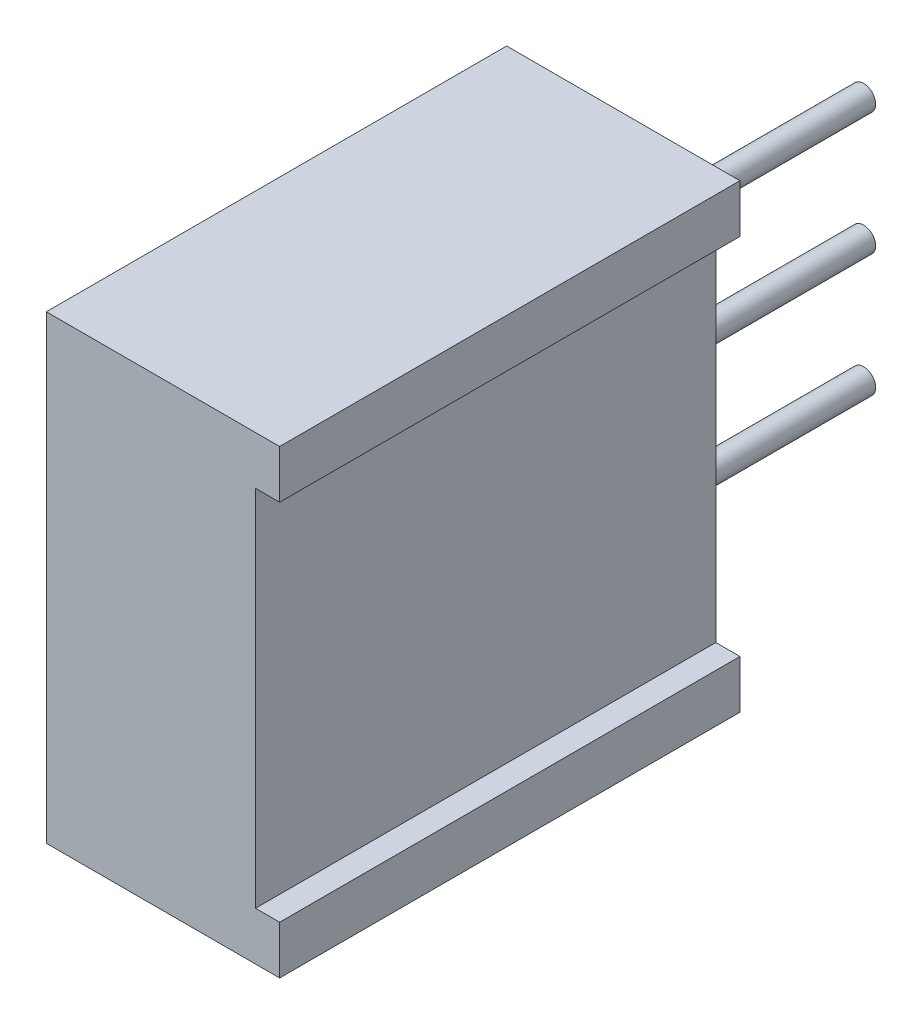
ISO-10303-21;
HEADER;
FILE_DESCRIPTION(('STEP AP214'),'2;1');
FILE_NAME('part.step','',(''),(''),'','','');
FILE_SCHEMA(('AUTOMOTIVE_DESIGN { 1 0 10303 214 1 1 1 1 }'));
ENDSEC;
DATA;
#1=APPLICATION_CONTEXT('core data for automotive mechanical design processes');
#2=APPLICATION_PROTOCOL_DEFINITION('international standard','automotive_design',2000,#1);
#3=PRODUCT_CONTEXT('',#1,'mechanical');
#4=PRODUCT('Part','Part','',(#3));
#5=PRODUCT_RELATED_PRODUCT_CATEGORY('part','',(#4));
#6=PRODUCT_DEFINITION_FORMATION('','',#4);
#7=PRODUCT_DEFINITION_CONTEXT('part definition',#1,'design');
#8=PRODUCT_DEFINITION('design','',#6,#7);
#9=PRODUCT_DEFINITION_SHAPE('','',#8);
#10=(LENGTH_UNIT() NAMED_UNIT(*) SI_UNIT(.MILLI.,.METRE.));
#11=(NAMED_UNIT(*) PLANE_ANGLE_UNIT() SI_UNIT($,.RADIAN.));
#12=(NAMED_UNIT(*) SI_UNIT($,.STERADIAN.) SOLID_ANGLE_UNIT());
#13=UNCERTAINTY_MEASURE_WITH_UNIT(LENGTH_MEASURE(1.E-05),#10,'distance_accuracy_value','');
#14=(GEOMETRIC_REPRESENTATION_CONTEXT(3) GLOBAL_UNCERTAINTY_ASSIGNED_CONTEXT((#13)) GLOBAL_UNIT_ASSIGNED_CONTEXT((#10,
#11,#12)) REPRESENTATION_CONTEXT('',''));
#15=CARTESIAN_POINT('',(0.,0.,0.));
#16=DIRECTION('',(0.,0.,1.));
#17=DIRECTION('',(1.,0.,0.));
#18=AXIS2_PLACEMENT_3D('',#15,#16,#17);
#19=CARTESIAN_POINT('',(4.83,0.,0.));
#20=DIRECTION('',(-1.,0.,0.));
#21=DIRECTION('',(0.,0.,1.));
#22=AXIS2_PLACEMENT_3D('',#19,#20,#21);
#23=PLANE('',#22);
#24=DIRECTION('',(0.,0.,1.));
#25=VECTOR('',#24,1.);
#26=CARTESIAN_POINT('',(4.83,-1.,0.));
#27=LINE('',#26,#25);
#28=CARTESIAN_POINT('',(4.83,-1.,0.));
#29=VERTEX_POINT('',#28);
#30=CARTESIAN_POINT('',(4.83,-1.,9.52999999999999));
#31=VERTEX_POINT('',#30);
#32=EDGE_CURVE('E42',#29,#31,#27,.T.);
#33=ORIENTED_EDGE('',*,*,#32,.F.);
#34=DIRECTION('',(0.,-1.,0.));
#35=VECTOR('',#34,1.);
#36=CARTESIAN_POINT('',(4.83,0.,0.));
#37=LINE('',#36,#35);
#38=CARTESIAN_POINT('',(4.83,0.,0.));
#39=VERTEX_POINT('',#38);
#40=EDGE_CURVE('E185',#39,#29,#37,.T.);
#41=ORIENTED_EDGE('',*,*,#40,.F.);
#42=DIRECTION('',(0.,0.,1.));
#43=VECTOR('',#42,1.);
#44=CARTESIAN_POINT('',(4.83,0.,0.));
#45=LINE('',#44,#43);
#46=CARTESIAN_POINT('',(4.83,0.,9.52999999999999));
#47=VERTEX_POINT('',#46);
#48=EDGE_CURVE('E146',#39,#47,#45,.T.);
#49=ORIENTED_EDGE('',*,*,#48,.T.);
#50=DIRECTION('',(0.,1.,0.));
#51=VECTOR('',#50,1.);
#52=CARTESIAN_POINT('',(4.83,-9.53,9.53));
#53=LINE('',#52,#51);
#54=EDGE_CURVE('E147',#31,#47,#53,.T.);
#55=ORIENTED_EDGE('',*,*,#54,.F.);
#56=EDGE_LOOP('',(#33,#41,#49,#55));
#57=FACE_BOUND('',#56,.T.);
#58=ADVANCED_FACE('F34',(#57),#23,.F.);
#59=CARTESIAN_POINT('',(4.83,0.,0.));
#60=DIRECTION('',(0.,0.,-1.));
#61=DIRECTION('',(-1.,0.,0.));
#62=AXIS2_PLACEMENT_3D('',#59,#60,#61);
#63=PLANE('',#62);
#64=DIRECTION('',(-1.,0.,0.));
#65=VECTOR('',#64,1.);
#66=CARTESIAN_POINT('',(4.83,-8.53,0.));
#67=LINE('',#66,#65);
#68=CARTESIAN_POINT('',(4.83,-8.53,0.));
#69=VERTEX_POINT('',#68);
#70=CARTESIAN_POINT('',(4.33,-8.53,0.));
#71=VERTEX_POINT('',#70);
#72=EDGE_CURVE('E249',#69,#71,#67,.T.);
#73=ORIENTED_EDGE('',*,*,#72,.F.);
#74=CARTESIAN_POINT('',(4.83,-9.53,0.));
#75=VERTEX_POINT('',#74);
#76=EDGE_CURVE('E141',#69,#75,#37,.T.);
#77=ORIENTED_EDGE('',*,*,#76,.T.);
#78=DIRECTION('',(-1.,0.,0.));
#79=VECTOR('',#78,1.);
#80=CARTESIAN_POINT('',(4.83,-9.53,0.));
#81=LINE('',#80,#79);
#82=CARTESIAN_POINT('',(0.,-9.53,0.));
#83=VERTEX_POINT('',#82);
#84=EDGE_CURVE('E150',#75,#83,#81,.T.);
#85=ORIENTED_EDGE('',*,*,#84,.T.);
#86=DIRECTION('',(0.,-1.,0.));
#87=VECTOR('',#86,1.);
#88=CARTESIAN_POINT('',(0.,0.,0.));
#89=LINE('',#88,#87);
#90=CARTESIAN_POINT('',(0.,0.,0.));
#91=VERTEX_POINT('',#90);
#92=EDGE_CURVE('E156',#91,#83,#89,.T.);
#93=ORIENTED_EDGE('',*,*,#92,.F.);
#94=DIRECTION('',(-1.,0.,0.));
#95=VECTOR('',#94,1.);
#96=CARTESIAN_POINT('',(4.83,0.,0.));
#97=LINE('',#96,#95);
#98=EDGE_CURVE('E169',#39,#91,#97,.T.);
#99=ORIENTED_EDGE('',*,*,#98,.F.);
#100=ORIENTED_EDGE('',*,*,#40,.T.);
#101=DIRECTION('',(-1.,0.,0.));
#102=VECTOR('',#101,1.);
#103=CARTESIAN_POINT('',(4.83,-1.,0.));
#104=LINE('',#103,#102);
#105=CARTESIAN_POINT('',(4.33,-1.,0.));
#106=VERTEX_POINT('',#105);
#107=EDGE_CURVE('E49',#29,#106,#104,.T.);
#108=ORIENTED_EDGE('',*,*,#107,.T.);
#109=DIRECTION('',(0.,-1.,0.));
#110=VECTOR('',#109,1.);
#111=CARTESIAN_POINT('',(4.33,0.,0.));
#112=LINE('',#111,#110);
#113=EDGE_CURVE('E244',#106,#71,#112,.T.);
#114=ORIENTED_EDGE('',*,*,#113,.T.);
#115=EDGE_LOOP('',(#73,#77,#85,#93,#99,#100,#108,#114));
#116=FACE_BOUND('',#115,.T.);
#117=CARTESIAN_POINT('',(2.39,-4.76500000000001,0.));
#118=DIRECTION('',(0.,0.,-1.));
#119=DIRECTION('',(-1.,0.,0.));
#120=AXIS2_PLACEMENT_3D('',#117,#118,#119);
#121=CIRCLE('',#120,0.25);
#122=CARTESIAN_POINT('',(2.14,-4.76500000000001,0.));
#123=VERTEX_POINT('',#122);
#124=EDGE_CURVE('E235',#123,#123,#121,.T.);
#125=ORIENTED_EDGE('',*,*,#124,.F.);
#126=EDGE_LOOP('',(#125));
#127=FACE_BOUND('',#126,.T.);
#128=CARTESIAN_POINT('',(2.39,-2.22500000000001,0.));
#129=DIRECTION('',(0.,0.,-1.));
#130=DIRECTION('',(-1.,0.,0.));
#131=AXIS2_PLACEMENT_3D('',#128,#129,#130);
#132=CIRCLE('',#131,0.25);
#133=CARTESIAN_POINT('',(2.14,-2.22500000000001,0.));
#134=VERTEX_POINT('',#133);
#135=EDGE_CURVE('E229',#134,#134,#132,.T.);
#136=ORIENTED_EDGE('',*,*,#135,.F.);
#137=EDGE_LOOP('',(#136));
#138=FACE_BOUND('',#137,.T.);
#139=CARTESIAN_POINT('',(2.39,-7.30500000000001,0.));
#140=DIRECTION('',(0.,0.,-1.));
#141=DIRECTION('',(-1.,0.,0.));
#142=AXIS2_PLACEMENT_3D('',#139,#140,#141);
#143=CIRCLE('',#142,0.25);
#144=CARTESIAN_POINT('',(2.14,-7.30500000000001,0.));
#145=VERTEX_POINT('',#144);
#146=EDGE_CURVE('E241',#145,#145,#143,.T.);
#147=ORIENTED_EDGE('',*,*,#146,.F.);
#148=EDGE_LOOP('',(#147));
#149=FACE_BOUND('',#148,.T.);
#150=ADVANCED_FACE('F36',(#116,#127,#138,#149),#63,.T.);
#151=CARTESIAN_POINT('',(0.1,-4.76500000000001,4.76500000000001));
#152=DIRECTION('',(1.,0.,0.));
#153=DIRECTION('',(0.,0.,-1.));
#154=AXIS2_PLACEMENT_3D('',#151,#152,#153);
#155=PLANE('',#154);
#156=DIRECTION('',(0.,-0.707106781186551,-0.707106781186544));
#157=VECTOR('',#156,1.);
#158=CARTESIAN_POINT('',(0.1,-3.74924699683036,6.48785978435619));
#159=LINE('',#158,#157);
#160=CARTESIAN_POINT('',(0.1,-3.74924699683036,6.48785978435619));
#161=VERTEX_POINT('',#160);
#162=CARTESIAN_POINT('',(0.1,-6.4878597843562,3.74924699683038));
#163=VERTEX_POINT('',#162);
#164=EDGE_CURVE('E217',#161,#163,#159,.T.);
#165=ORIENTED_EDGE('',*,*,#164,.T.);
#166=CARTESIAN_POINT('',(0.1,-4.76500000000001,4.76500000000001));
#167=DIRECTION('',(1.,0.,0.));
#168=DIRECTION('',(0.,0.,-1.));
#169=AXIS2_PLACEMENT_3D('',#166,#167,#168);
#170=CIRCLE('',#169,2.);
#171=EDGE_CURVE('E160',#161,#163,#170,.T.);
#172=ORIENTED_EDGE('',*,*,#171,.F.);
#173=EDGE_LOOP('',(#165,#172));
#174=FACE_BOUND('',#173,.T.);
#175=ADVANCED_FACE('F259',(#174),#155,.F.);
#176=CARTESIAN_POINT('',(0.,0.,0.));
#177=DIRECTION('',(-1.,0.,0.));
#178=DIRECTION('',(0.,0.,1.));
#179=AXIS2_PLACEMENT_3D('',#176,#177,#178);
#180=PLANE('',#179);
#181=ORIENTED_EDGE('',*,*,#92,.T.);
#182=DIRECTION('',(0.,0.,-1.));
#183=VECTOR('',#182,1.);
#184=CARTESIAN_POINT('',(0.,-9.53,9.53));
#185=LINE('',#184,#183);
#186=CARTESIAN_POINT('',(0.,-9.53,9.53));
#187=VERTEX_POINT('',#186);
#188=EDGE_CURVE('E159',#187,#83,#185,.T.);
#189=ORIENTED_EDGE('',*,*,#188,.F.);
#190=DIRECTION('',(0.,1.,0.));
#191=VECTOR('',#190,1.);
#192=CARTESIAN_POINT('',(0.,-9.53,9.53));
#193=LINE('',#192,#191);
#194=CARTESIAN_POINT('',(0.,0.,9.52999999999999));
#195=VERTEX_POINT('',#194);
#196=EDGE_CURVE('E163',#187,#195,#193,.T.);
#197=ORIENTED_EDGE('',*,*,#196,.T.);
#198=DIRECTION('',(0.,0.,1.));
#199=VECTOR('',#198,1.);
#200=CARTESIAN_POINT('',(0.,0.,0.));
#201=LINE('',#200,#199);
#202=EDGE_CURVE('E166',#91,#195,#201,.T.);
#203=ORIENTED_EDGE('',*,*,#202,.F.);
#204=EDGE_LOOP('',(#181,#189,#197,#203));
#205=FACE_BOUND('',#204,.T.);
#206=CARTESIAN_POINT('',(0.,-4.76500000000001,4.76500000000001));
#207=DIRECTION('',(1.,0.,0.));
#208=DIRECTION('',(0.,0.,-1.));
#209=AXIS2_PLACEMENT_3D('',#206,#207,#208);
#210=CIRCLE('',#209,2.);
#211=CARTESIAN_POINT('',(0.,-4.76500000000001,2.76500000000001));
#212=VERTEX_POINT('',#211);
#213=EDGE_CURVE('E199',#212,#212,#210,.T.);
#214=ORIENTED_EDGE('',*,*,#213,.T.);
#215=EDGE_LOOP('',(#214));
#216=FACE_BOUND('',#215,.T.);
#217=ADVANCED_FACE('F191',(#205,#216),#180,.T.);
#218=CARTESIAN_POINT('',(4.83,0.,0.));
#219=DIRECTION('',(0.,-1.,0.));
#220=DIRECTION('',(0.,0.,-1.));
#221=AXIS2_PLACEMENT_3D('',#218,#219,#220);
#222=PLANE('',#221);
#223=ORIENTED_EDGE('',*,*,#202,.T.);
#224=DIRECTION('',(-1.,0.,0.));
#225=VECTOR('',#224,1.);
#226=CARTESIAN_POINT('',(4.83,0.,9.52999999999999));
#227=LINE('',#226,#225);
#228=EDGE_CURVE('E171',#47,#195,#227,.T.);
#229=ORIENTED_EDGE('',*,*,#228,.F.);
#230=ORIENTED_EDGE('',*,*,#48,.F.);
#231=ORIENTED_EDGE('',*,*,#98,.T.);
#232=EDGE_LOOP('',(#223,#229,#230,#231));
#233=FACE_BOUND('',#232,.T.);
#234=ADVANCED_FACE('F187',(#233),#222,.F.);
#235=CARTESIAN_POINT('',(4.83,-9.53,9.53));
#236=DIRECTION('',(0.,0.,1.));
#237=DIRECTION('',(0.,-1.,0.));
#238=AXIS2_PLACEMENT_3D('',#235,#236,#237);
#239=PLANE('',#238);
#240=DIRECTION('',(1.,0.,0.));
#241=VECTOR('',#240,1.);
#242=CARTESIAN_POINT('',(4.33,-8.53,9.52999999999999));
#243=LINE('',#242,#241);
#244=CARTESIAN_POINT('',(4.33,-8.53,9.52999999999999));
#245=VERTEX_POINT('',#244);
#246=CARTESIAN_POINT('',(4.83,-8.53,9.52999999999999));
#247=VERTEX_POINT('',#246);
#248=EDGE_CURVE('E124',#245,#247,#243,.T.);
#249=ORIENTED_EDGE('',*,*,#248,.F.);
#250=DIRECTION('',(0.,1.,0.));
#251=VECTOR('',#250,1.);
#252=CARTESIAN_POINT('',(4.33,-8.53,9.52999999999999));
#253=LINE('',#252,#251);
#254=CARTESIAN_POINT('',(4.33,-1.,9.52999999999999));
#255=VERTEX_POINT('',#254);
#256=EDGE_CURVE('E181',#245,#255,#253,.T.);
#257=ORIENTED_EDGE('',*,*,#256,.T.);
#258=DIRECTION('',(1.,0.,0.));
#259=VECTOR('',#258,1.);
#260=CARTESIAN_POINT('',(4.33,-1.,9.52999999999999));
#261=LINE('',#260,#259);
#262=EDGE_CURVE('E133',#255,#31,#261,.T.);
#263=ORIENTED_EDGE('',*,*,#262,.T.);
#264=ORIENTED_EDGE('',*,*,#54,.T.);
#265=ORIENTED_EDGE('',*,*,#228,.T.);
#266=ORIENTED_EDGE('',*,*,#196,.F.);
#267=DIRECTION('',(-1.,0.,0.));
#268=VECTOR('',#267,1.);
#269=CARTESIAN_POINT('',(4.83,-9.53,9.53));
#270=LINE('',#269,#268);
#271=CARTESIAN_POINT('',(4.83,-9.53,9.53));
#272=VERTEX_POINT('',#271);
#273=EDGE_CURVE('E144',#272,#187,#270,.T.);
#274=ORIENTED_EDGE('',*,*,#273,.F.);
#275=EDGE_CURVE('E140',#272,#247,#53,.T.);
#276=ORIENTED_EDGE('',*,*,#275,.T.);
#277=EDGE_LOOP('',(#249,#257,#263,#264,#265,#266,#274,#276));
#278=FACE_BOUND('',#277,.T.);
#279=ADVANCED_FACE('F142',(#278),#239,.T.);
#280=CARTESIAN_POINT('',(4.83,-9.53,9.53));
#281=DIRECTION('',(0.,1.,0.));
#282=DIRECTION('',(0.,0.,1.));
#283=AXIS2_PLACEMENT_3D('',#280,#281,#282);
#284=PLANE('',#283);
#285=ORIENTED_EDGE('',*,*,#188,.T.);
#286=ORIENTED_EDGE('',*,*,#84,.F.);
#287=DIRECTION('',(0.,0.,-1.));
#288=VECTOR('',#287,1.);
#289=CARTESIAN_POINT('',(4.83,-9.53,9.53));
#290=LINE('',#289,#288);
#291=EDGE_CURVE('E152',#272,#75,#290,.T.);
#292=ORIENTED_EDGE('',*,*,#291,.F.);
#293=ORIENTED_EDGE('',*,*,#273,.T.);
#294=EDGE_LOOP('',(#285,#286,#292,#293));
#295=FACE_BOUND('',#294,.T.);
#296=ADVANCED_FACE('F196',(#295),#284,.F.);
#297=ORIENTED_EDGE('',*,*,#76,.F.);
#298=DIRECTION('',(0.,0.,1.));
#299=VECTOR('',#298,1.);
#300=CARTESIAN_POINT('',(4.83,-8.53,0.));
#301=LINE('',#300,#299);
#302=EDGE_CURVE('E12',#69,#247,#301,.T.);
#303=ORIENTED_EDGE('',*,*,#302,.T.);
#304=ORIENTED_EDGE('',*,*,#275,.F.);
#305=ORIENTED_EDGE('',*,*,#291,.T.);
#306=EDGE_LOOP('',(#297,#303,#304,#305));
#307=FACE_BOUND('',#306,.T.);
#308=ADVANCED_FACE('F138',(#307),#23,.F.);
#309=CARTESIAN_POINT('',(0.1,-4.76500000000001,4.76500000000001));
#310=DIRECTION('',(-1.,0.,0.));
#311=DIRECTION('',(0.,0.,1.));
#312=AXIS2_PLACEMENT_3D('',#309,#310,#311);
#313=CYLINDRICAL_SURFACE('',#312,2.);
#314=CARTESIAN_POINT('',(0.1,-5.78075300316966,3.04214021564382));
#315=VERTEX_POINT('',#314);
#316=CARTESIAN_POINT('',(0.1,-3.04214021564381,5.78075300316964));
#317=VERTEX_POINT('',#316);
#318=EDGE_CURVE('E202',#315,#317,#170,.T.);
#319=ORIENTED_EDGE('',*,*,#318,.T.);
#320=DIRECTION('',(-1.,0.,0.));
#321=VECTOR('',#320,1.);
#322=CARTESIAN_POINT('',(1.1,-3.04214021564381,5.78075300316964));
#323=LINE('',#322,#321);
#324=CARTESIAN_POINT('',(1.1,-3.04214021564381,5.78075300316964));
#325=VERTEX_POINT('',#324);
#326=EDGE_CURVE('E210',#325,#317,#323,.T.);
#327=ORIENTED_EDGE('',*,*,#326,.F.);
#328=CARTESIAN_POINT('',(1.1,-4.76500000000001,4.76500000000001));
#329=DIRECTION('',(-1.,0.,0.));
#330=DIRECTION('',(0.,0.,1.));
#331=AXIS2_PLACEMENT_3D('',#328,#329,#330);
#332=CIRCLE('',#331,2.);
#333=CARTESIAN_POINT('',(1.1,-3.74924699683036,6.48785978435619));
#334=VERTEX_POINT('',#333);
#335=EDGE_CURVE('E222',#334,#325,#332,.T.);
#336=ORIENTED_EDGE('',*,*,#335,.F.);
#337=DIRECTION('',(-1.,0.,0.));
#338=VECTOR('',#337,1.);
#339=CARTESIAN_POINT('',(1.1,-3.74924699683036,6.48785978435619));
#340=LINE('',#339,#338);
#341=EDGE_CURVE('E207',#334,#161,#340,.T.);
#342=ORIENTED_EDGE('',*,*,#341,.T.);
#343=ORIENTED_EDGE('',*,*,#171,.T.);
#344=DIRECTION('',(-1.,0.,0.));
#345=VECTOR('',#344,1.);
#346=CARTESIAN_POINT('',(1.1,-6.4878597843562,3.74924699683037));
#347=LINE('',#346,#345);
#348=CARTESIAN_POINT('',(1.1,-6.4878597843562,3.74924699683037));
#349=VERTEX_POINT('',#348);
#350=EDGE_CURVE('E57',#349,#163,#347,.T.);
#351=ORIENTED_EDGE('',*,*,#350,.F.);
#352=CARTESIAN_POINT('',(1.1,-4.76500000000001,4.76500000000001));
#353=DIRECTION('',(-1.,0.,0.));
#354=DIRECTION('',(0.,0.,1.));
#355=AXIS2_PLACEMENT_3D('',#352,#353,#354);
#356=CIRCLE('',#355,2.);
#357=CARTESIAN_POINT('',(1.1,-5.78075300316966,3.04214021564382));
#358=VERTEX_POINT('',#357);
#359=EDGE_CURVE('E216',#358,#349,#356,.T.);
#360=ORIENTED_EDGE('',*,*,#359,.F.);
#361=DIRECTION('',(-1.,0.,0.));
#362=VECTOR('',#361,1.);
#363=CARTESIAN_POINT('',(1.1,-5.78075300316966,3.04214021564382));
#364=LINE('',#363,#362);
#365=EDGE_CURVE('E203',#358,#315,#364,.T.);
#366=ORIENTED_EDGE('',*,*,#365,.T.);
#367=EDGE_LOOP('',(#319,#327,#336,#342,#343,#351,#360,#366));
#368=FACE_BOUND('',#367,.T.);
#369=ORIENTED_EDGE('',*,*,#213,.F.);
#370=EDGE_LOOP('',(#369));
#371=FACE_BOUND('',#370,.T.);
#372=ADVANCED_FACE('F289',(#368,#371),#313,.F.);
#373=ORIENTED_EDGE('',*,*,#318,.F.);
#374=DIRECTION('',(0.,-0.707106781186551,-0.707106781186544));
#375=VECTOR('',#374,1.);
#376=CARTESIAN_POINT('',(0.1,-3.04214021564381,5.78075300316964));
#377=LINE('',#376,#375);
#378=EDGE_CURVE('E213',#317,#315,#377,.T.);
#379=ORIENTED_EDGE('',*,*,#378,.F.);
#380=EDGE_LOOP('',(#373,#379));
#381=FACE_BOUND('',#380,.T.);
#382=ADVANCED_FACE('F294',(#381),#155,.F.);
#383=CARTESIAN_POINT('',(1.1,-3.04214021564381,5.78075300316964));
#384=DIRECTION('',(0.,0.707106781186544,-0.707106781186551));
#385=DIRECTION('',(0.,0.707106781186551,0.707106781186544));
#386=AXIS2_PLACEMENT_3D('',#383,#384,#385);
#387=PLANE('',#386);
#388=ORIENTED_EDGE('',*,*,#378,.T.);
#389=ORIENTED_EDGE('',*,*,#365,.F.);
#390=DIRECTION('',(0.,-0.707106781186551,-0.707106781186544));
#391=VECTOR('',#390,1.);
#392=CARTESIAN_POINT('',(1.1,-3.04214021564381,5.78075300316964));
#393=LINE('',#392,#391);
#394=EDGE_CURVE('E208',#325,#358,#393,.T.);
#395=ORIENTED_EDGE('',*,*,#394,.F.);
#396=ORIENTED_EDGE('',*,*,#326,.T.);
#397=EDGE_LOOP('',(#388,#389,#395,#396));
#398=FACE_BOUND('',#397,.T.);
#399=ADVANCED_FACE('F312',(#398),#387,.F.);
#400=CARTESIAN_POINT('',(1.1,-3.74924699683036,6.48785978435619));
#401=DIRECTION('',(0.,0.707106781186544,-0.707106781186551));
#402=DIRECTION('',(0.,0.707106781186551,0.707106781186544));
#403=AXIS2_PLACEMENT_3D('',#400,#401,#402);
#404=PLANE('',#403);
#405=ORIENTED_EDGE('',*,*,#164,.F.);
#406=ORIENTED_EDGE('',*,*,#341,.F.);
#407=DIRECTION('',(0.,-0.707106781186551,-0.707106781186544));
#408=VECTOR('',#407,1.);
#409=CARTESIAN_POINT('',(1.1,-3.74924699683036,6.48785978435619));
#410=LINE('',#409,#408);
#411=EDGE_CURVE('E225',#334,#349,#410,.T.);
#412=ORIENTED_EDGE('',*,*,#411,.T.);
#413=ORIENTED_EDGE('',*,*,#350,.T.);
#414=EDGE_LOOP('',(#405,#406,#412,#413));
#415=FACE_BOUND('',#414,.T.);
#416=ADVANCED_FACE('F317',(#415),#404,.T.);
#417=CARTESIAN_POINT('',(1.1,-4.76500000000001,4.76500000000001));
#418=DIRECTION('',(-1.,0.,0.));
#419=DIRECTION('',(0.,0.,1.));
#420=AXIS2_PLACEMENT_3D('',#417,#418,#419);
#421=PLANE('',#420);
#422=ORIENTED_EDGE('',*,*,#359,.T.);
#423=ORIENTED_EDGE('',*,*,#411,.F.);
#424=ORIENTED_EDGE('',*,*,#335,.T.);
#425=ORIENTED_EDGE('',*,*,#394,.T.);
#426=EDGE_LOOP('',(#422,#423,#424,#425));
#427=FACE_BOUND('',#426,.T.);
#428=ADVANCED_FACE('F327',(#427),#421,.T.);
#429=CARTESIAN_POINT('',(2.39,-2.22500000000001,-5.));
#430=DIRECTION('',(0.,0.,1.));
#431=DIRECTION('',(1.,0.,0.));
#432=AXIS2_PLACEMENT_3D('',#429,#430,#431);
#433=CYLINDRICAL_SURFACE('',#432,0.25);
#434=CARTESIAN_POINT('',(2.39,-2.22500000000001,-5.));
#435=DIRECTION('',(0.,0.,-1.));
#436=DIRECTION('',(-1.,0.,0.));
#437=AXIS2_PLACEMENT_3D('',#434,#435,#436);
#438=CIRCLE('',#437,0.25);
#439=CARTESIAN_POINT('',(2.14,-2.22500000000001,-5.));
#440=VERTEX_POINT('',#439);
#441=EDGE_CURVE('E219',#440,#440,#438,.T.);
#442=ORIENTED_EDGE('',*,*,#441,.F.);
#443=EDGE_LOOP('',(#442));
#444=FACE_BOUND('',#443,.T.);
#445=ORIENTED_EDGE('',*,*,#135,.T.);
#446=EDGE_LOOP('',(#445));
#447=FACE_BOUND('',#446,.T.);
#448=ADVANCED_FACE('F335',(#444,#447),#433,.T.);
#449=CARTESIAN_POINT('',(2.39,-2.22500000000001,-5.));
#450=DIRECTION('',(0.,0.,-1.));
#451=DIRECTION('',(-1.,0.,0.));
#452=AXIS2_PLACEMENT_3D('',#449,#450,#451);
#453=PLANE('',#452);
#454=ORIENTED_EDGE('',*,*,#441,.T.);
#455=EDGE_LOOP('',(#454));
#456=FACE_BOUND('',#455,.T.);
#457=ADVANCED_FACE('F340',(#456),#453,.T.);
#458=CARTESIAN_POINT('',(2.39,-4.76500000000001,-5.));
#459=DIRECTION('',(0.,0.,1.));
#460=DIRECTION('',(1.,0.,0.));
#461=AXIS2_PLACEMENT_3D('',#458,#459,#460);
#462=CYLINDRICAL_SURFACE('',#461,0.25);
#463=CARTESIAN_POINT('',(2.39,-4.76500000000001,-5.));
#464=DIRECTION('',(0.,0.,-1.));
#465=DIRECTION('',(-1.,0.,0.));
#466=AXIS2_PLACEMENT_3D('',#463,#464,#465);
#467=CIRCLE('',#466,0.25);
#468=CARTESIAN_POINT('',(2.14,-4.76500000000001,-5.));
#469=VERTEX_POINT('',#468);
#470=EDGE_CURVE('E232',#469,#469,#467,.T.);
#471=ORIENTED_EDGE('',*,*,#470,.F.);
#472=EDGE_LOOP('',(#471));
#473=FACE_BOUND('',#472,.T.);
#474=ORIENTED_EDGE('',*,*,#124,.T.);
#475=EDGE_LOOP('',(#474));
#476=FACE_BOUND('',#475,.T.);
#477=ADVANCED_FACE('F278',(#473,#476),#462,.T.);
#478=CARTESIAN_POINT('',(2.39,-4.76500000000001,-5.));
#479=DIRECTION('',(0.,0.,-1.));
#480=DIRECTION('',(-1.,0.,0.));
#481=AXIS2_PLACEMENT_3D('',#478,#479,#480);
#482=PLANE('',#481);
#483=ORIENTED_EDGE('',*,*,#470,.T.);
#484=EDGE_LOOP('',(#483));
#485=FACE_BOUND('',#484,.T.);
#486=ADVANCED_FACE('F269',(#485),#482,.T.);
#487=CARTESIAN_POINT('',(2.39,-7.30500000000001,-5.));
#488=DIRECTION('',(0.,0.,1.));
#489=DIRECTION('',(1.,0.,0.));
#490=AXIS2_PLACEMENT_3D('',#487,#488,#489);
#491=CYLINDRICAL_SURFACE('',#490,0.25);
#492=CARTESIAN_POINT('',(2.39,-7.30500000000001,-5.));
#493=DIRECTION('',(0.,0.,-1.));
#494=DIRECTION('',(-1.,0.,0.));
#495=AXIS2_PLACEMENT_3D('',#492,#493,#494);
#496=CIRCLE('',#495,0.25);
#497=CARTESIAN_POINT('',(2.14,-7.30500000000001,-5.));
#498=VERTEX_POINT('',#497);
#499=EDGE_CURVE('E238',#498,#498,#496,.T.);
#500=ORIENTED_EDGE('',*,*,#499,.F.);
#501=EDGE_LOOP('',(#500));
#502=FACE_BOUND('',#501,.T.);
#503=ORIENTED_EDGE('',*,*,#146,.T.);
#504=EDGE_LOOP('',(#503));
#505=FACE_BOUND('',#504,.T.);
#506=ADVANCED_FACE('F266',(#502,#505),#491,.T.);
#507=CARTESIAN_POINT('',(2.39,-7.30500000000001,-5.));
#508=DIRECTION('',(0.,0.,-1.));
#509=DIRECTION('',(-1.,0.,0.));
#510=AXIS2_PLACEMENT_3D('',#507,#508,#509);
#511=PLANE('',#510);
#512=ORIENTED_EDGE('',*,*,#499,.T.);
#513=EDGE_LOOP('',(#512));
#514=FACE_BOUND('',#513,.T.);
#515=ADVANCED_FACE('F268',(#514),#511,.T.);
#516=CARTESIAN_POINT('',(4.33,-8.53,-5.));
#517=DIRECTION('',(0.,-1.,0.));
#518=DIRECTION('',(0.,0.,-1.));
#519=AXIS2_PLACEMENT_3D('',#516,#517,#518);
#520=PLANE('',#519);
#521=ORIENTED_EDGE('',*,*,#72,.T.);
#522=DIRECTION('',(0.,0.,1.));
#523=VECTOR('',#522,1.);
#524=CARTESIAN_POINT('',(4.33,-8.53,-5.));
#525=LINE('',#524,#523);
#526=EDGE_CURVE('E128',#71,#245,#525,.T.);
#527=ORIENTED_EDGE('',*,*,#526,.T.);
#528=ORIENTED_EDGE('',*,*,#248,.T.);
#529=ORIENTED_EDGE('',*,*,#302,.F.);
#530=EDGE_LOOP('',(#521,#527,#528,#529));
#531=FACE_BOUND('',#530,.T.);
#532=ADVANCED_FACE('F125',(#531),#520,.F.);
#533=CARTESIAN_POINT('',(4.33,-8.53,-5.));
#534=DIRECTION('',(1.,0.,0.));
#535=DIRECTION('',(0.,1.,0.));
#536=AXIS2_PLACEMENT_3D('',#533,#534,#535);
#537=PLANE('',#536);
#538=DIRECTION('',(0.,0.,1.));
#539=VECTOR('',#538,1.);
#540=CARTESIAN_POINT('',(4.33,-1.,-5.));
#541=LINE('',#540,#539);
#542=EDGE_CURVE('E252',#106,#255,#541,.T.);
#543=ORIENTED_EDGE('',*,*,#542,.T.);
#544=ORIENTED_EDGE('',*,*,#256,.F.);
#545=ORIENTED_EDGE('',*,*,#526,.F.);
#546=ORIENTED_EDGE('',*,*,#113,.F.);
#547=EDGE_LOOP('',(#543,#544,#545,#546));
#548=FACE_BOUND('',#547,.T.);
#549=ADVANCED_FACE('F256',(#548),#537,.T.);
#550=CARTESIAN_POINT('',(4.33,-1.,-5.));
#551=DIRECTION('',(0.,-1.,0.));
#552=DIRECTION('',(1.,0.,0.));
#553=AXIS2_PLACEMENT_3D('',#550,#551,#552);
#554=PLANE('',#553);
#555=ORIENTED_EDGE('',*,*,#32,.T.);
#556=ORIENTED_EDGE('',*,*,#262,.F.);
#557=ORIENTED_EDGE('',*,*,#542,.F.);
#558=ORIENTED_EDGE('',*,*,#107,.F.);
#559=EDGE_LOOP('',(#555,#556,#557,#558));
#560=FACE_BOUND('',#559,.T.);
#561=ADVANCED_FACE('F176',(#560),#554,.T.);
#562=CLOSED_SHELL('',(#58,#150,#175,#217,#234,#279,#296,#308,#372,#382,#399,#416,#428,#448,#457,
#477,#486,#506,#515,#532,#549,#561));
#563=MANIFOLD_SOLID_BREP('B2',#562);
#564=ADVANCED_BREP_SHAPE_REPRESENTATION('',(#18,#563),#14);
#565=SHAPE_DEFINITION_REPRESENTATION(#9,#564);
ENDSEC;
END-ISO-10303-21;
